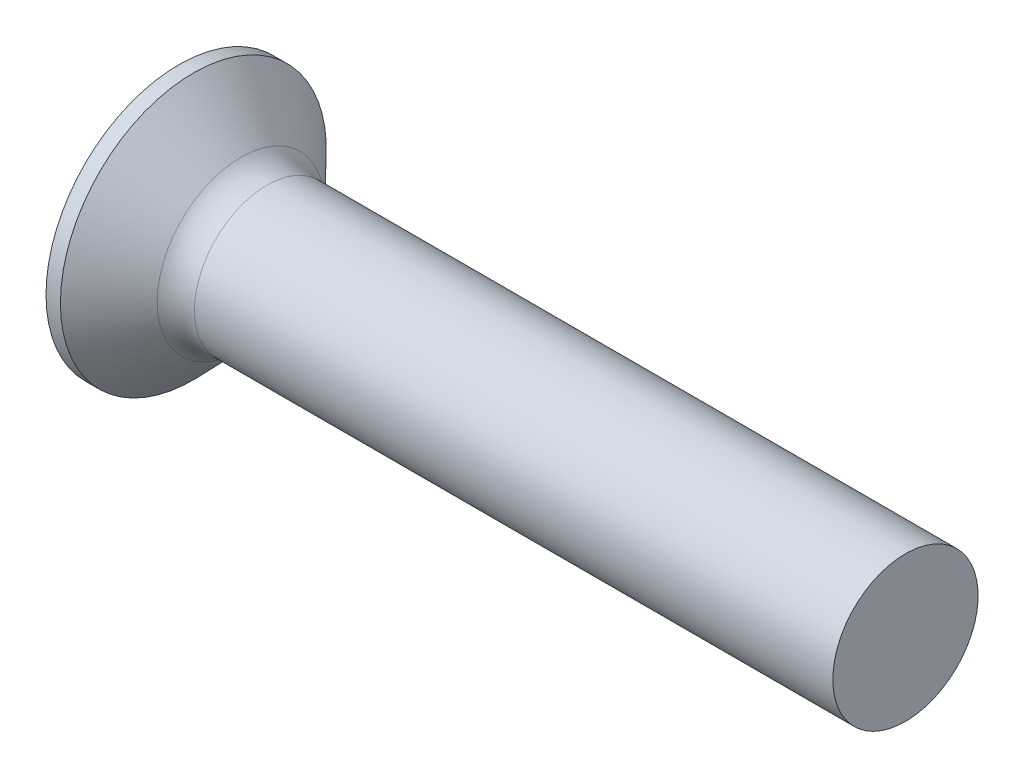
ISO-10303-21;
HEADER;
FILE_DESCRIPTION(('STEP AP214'),'2;1');
FILE_NAME('part.step','',(''),(''),'','','');
FILE_SCHEMA(('AUTOMOTIVE_DESIGN { 1 0 10303 214 1 1 1 1 }'));
ENDSEC;
DATA;
#1=APPLICATION_CONTEXT('core data for automotive mechanical design processes');
#2=APPLICATION_PROTOCOL_DEFINITION('international standard','automotive_design',2000,#1);
#3=PRODUCT_CONTEXT('',#1,'mechanical');
#4=PRODUCT('Part','Part','',(#3));
#5=PRODUCT_RELATED_PRODUCT_CATEGORY('part','',(#4));
#6=PRODUCT_DEFINITION_FORMATION('','',#4);
#7=PRODUCT_DEFINITION_CONTEXT('part definition',#1,'design');
#8=PRODUCT_DEFINITION('design','',#6,#7);
#9=PRODUCT_DEFINITION_SHAPE('','',#8);
#10=(LENGTH_UNIT() NAMED_UNIT(*) SI_UNIT(.MILLI.,.METRE.));
#11=(NAMED_UNIT(*) PLANE_ANGLE_UNIT() SI_UNIT($,.RADIAN.));
#12=(NAMED_UNIT(*) SI_UNIT($,.STERADIAN.) SOLID_ANGLE_UNIT());
#13=UNCERTAINTY_MEASURE_WITH_UNIT(LENGTH_MEASURE(1.E-05),#10,'distance_accuracy_value','');
#14=(GEOMETRIC_REPRESENTATION_CONTEXT(3) GLOBAL_UNCERTAINTY_ASSIGNED_CONTEXT((#13)) GLOBAL_UNIT_ASSIGNED_CONTEXT((#10,
#11,#12)) REPRESENTATION_CONTEXT('',''));
#15=CARTESIAN_POINT('',(0.,0.,0.));
#16=DIRECTION('',(0.,0.,1.));
#17=DIRECTION('',(1.,0.,0.));
#18=AXIS2_PLACEMENT_3D('',#15,#16,#17);
#19=CARTESIAN_POINT('',(5.64,-2.08800020083358,1.08));
#20=DIRECTION('',(0.,0.,-1.));
#21=DIRECTION('',(0.,1.,0.));
#22=AXIS2_PLACEMENT_3D('',#19,#20,#21);
#23=PLANE('',#22);
#24=DIRECTION('',(0.,-1.,0.));
#25=VECTOR('',#24,1.);
#26=CARTESIAN_POINT('',(0.,4.9,1.08));
#27=LINE('',#26,#25);
#28=CARTESIAN_POINT('',(0.,-2.05881047761803,1.08));
#29=VERTEX_POINT('',#28);
#30=CARTESIAN_POINT('',(0.,-4.9,1.08));
#31=VERTEX_POINT('',#30);
#32=EDGE_CURVE('E304',#29,#31,#27,.T.);
#33=ORIENTED_EDGE('',*,*,#32,.F.);
#34=CARTESIAN_POINT('',(-3.508552371452,-2.33231165002222,1.08));
#35=CARTESIAN_POINT('',(-2.8021242785535,-2.27786290347494,1.08));
#36=CARTESIAN_POINT('',(-2.09572000083794,-2.22310096882498,1.08));
#37=CARTESIAN_POINT('',(-0.682963739884883,-2.11273813340588,1.08));
#38=CARTESIAN_POINT('',(0.023388242128016,-2.05713721697088,1.08));
#39=CARTESIAN_POINT('',(1.08285390271521,-1.97294867301993,1.08));
#40=CARTESIAN_POINT('',(1.43599884659094,-1.94475462132179,1.08));
#41=CARTESIAN_POINT('',(2.14226366201043,-1.88806550876942,1.08));
#42=CARTESIAN_POINT('',(2.49538353361693,-1.8595704486972,1.08));
#43=CARTESIAN_POINT('',(3.2015889523463,-1.8022365024152,1.08));
#44=CARTESIAN_POINT('',(3.55467449997447,-1.77339762243347,1.08));
#45=CARTESIAN_POINT('',(4.26081605784269,-1.71532132056914,1.08));
#46=CARTESIAN_POINT('',(4.61387206778542,-1.68608389507013,1.08));
#47=CARTESIAN_POINT('',(5.41612732471709,-1.61911650604659,1.08));
#48=CARTESIAN_POINT('',(5.86531460668916,-1.58124295320442,1.08));
#49=CARTESIAN_POINT('',(6.76360881538388,-1.50456871786306,1.08));
#50=CARTESIAN_POINT('',(7.21271574234448,-1.46576803815681,1.08));
#51=CARTESIAN_POINT('',(8.11080846678724,-1.38699687421515,1.08));
#52=CARTESIAN_POINT('',(8.55979426851681,-1.34702643850978,1.08));
#53=CARTESIAN_POINT('',(9.45763439362018,-1.26556606443146,1.08));
#54=CARTESIAN_POINT('',(9.90648871523721,-1.22407610661242,1.08));
#55=CARTESIAN_POINT('',(10.804086472022,-1.13904091064148,1.08));
#56=CARTESIAN_POINT('',(11.2528298716191,-1.09549529593565,1.08));
#57=CARTESIAN_POINT('',(12.1500162616112,-1.00552937785306,1.08));
#58=CARTESIAN_POINT('',(12.5984592620319,-0.959109175798602,1.08));
#59=CARTESIAN_POINT('',(13.2708059653168,-0.8861578155995,1.08));
#60=CARTESIAN_POINT('',(13.4948891256712,-0.861284749868425,1.08));
#61=CARTESIAN_POINT('',(13.9428873803505,-0.810096676380915,1.08));
#62=CARTESIAN_POINT('',(14.1668024775431,-0.783781693824127,1.08));
#63=CARTESIAN_POINT('',(14.6144284155526,-0.729227223623335,1.08));
#64=CARTESIAN_POINT('',(14.8381392281789,-0.700987502036454,1.08));
#65=CARTESIAN_POINT('',(15.1734409779729,-0.656575769482208,1.08));
#66=CARTESIAN_POINT('',(15.2851674140663,-0.64142936052081,1.08));
#67=CARTESIAN_POINT('',(15.5085023247459,-0.610277030221323,1.08));
#68=CARTESIAN_POINT('',(15.6201107970542,-0.594271092583295,1.08));
#69=CARTESIAN_POINT('',(15.731644359719,-0.577747837441693,1.08));
#70=B_SPLINE_CURVE_WITH_KNOTS('',3,(#34,#35,#36,#37,#38,#39,#40,#41,#42,#43,#44,#45,#46,#47,#48,
#49,#50,#51,#52,#53,#54,#55,#56,#57,#58,#59,#60,#61,#62,#63,#64,#65,#66,#67,#68,#69),
.UNSPECIFIED.,.F.,.F.,(4,2,2,2,2,2,2,2,2,2,2,2,2,2,2,2,2,4),(0.,2.12557045381571,
4.25118064652266,5.31398639952898,6.37678939206669,7.4395731618212,8.50236658170693,
9.85470917308544,11.2070476910761,12.559330183477,13.9116299877686,15.2641784740572,
16.6166793133679,17.2930539423714,17.9694167544874,18.6458619223979,18.984104295463,
19.3223530851586),.UNSPECIFIED.);
#71=CARTESIAN_POINT('',(5.64,-1.60013444747621,1.08));
#72=VERTEX_POINT('',#71);
#73=EDGE_CURVE('E190',#29,#72,#70,.T.);
#74=ORIENTED_EDGE('',*,*,#73,.T.);
#75=DIRECTION('',(0.,-1.,0.));
#76=VECTOR('',#75,1.);
#77=CARTESIAN_POINT('',(5.64,2.08800020083358,1.08));
#78=LINE('',#77,#76);
#79=CARTESIAN_POINT('',(5.64,-2.08800020083358,1.08));
#80=VERTEX_POINT('',#79);
#81=EDGE_CURVE('E328',#72,#80,#78,.T.);
#82=ORIENTED_EDGE('',*,*,#81,.T.);
#83=DIRECTION('',(0.894934391398443,0.446197753347436,0.));
#84=VECTOR('',#83,1.);
#85=CARTESIAN_POINT('',(0.,-4.9,1.08));
#86=LINE('',#85,#84);
#87=EDGE_CURVE('E315',#31,#80,#86,.T.);
#88=ORIENTED_EDGE('',*,*,#87,.F.);
#89=EDGE_LOOP('',(#33,#74,#82,#88));
#90=FACE_BOUND('',#89,.T.);
#91=ADVANCED_FACE('F34',(#90),#23,.T.);
#92=CARTESIAN_POINT('',(5.64,2.08800020083359,1.08));
#93=VERTEX_POINT('',#92);
#94=CARTESIAN_POINT('',(5.64,1.60013444747621,1.08));
#95=VERTEX_POINT('',#94);
#96=EDGE_CURVE('E330',#93,#95,#78,.T.);
#97=ORIENTED_EDGE('',*,*,#96,.T.);
#98=CARTESIAN_POINT('',(-3.508552371452,2.33231165002222,1.08));
#99=CARTESIAN_POINT('',(-2.8021242785535,2.27786290347494,1.08));
#100=CARTESIAN_POINT('',(-2.09572000083793,2.22310096882498,1.08));
#101=CARTESIAN_POINT('',(-0.682963739884882,2.11273813340588,1.08));
#102=CARTESIAN_POINT('',(0.0233882421280164,2.05713721697088,1.08));
#103=CARTESIAN_POINT('',(1.08285390271521,1.97294867301993,1.08));
#104=CARTESIAN_POINT('',(1.43599884659094,1.94475462132179,1.08));
#105=CARTESIAN_POINT('',(2.14226366201043,1.88806550876942,1.08));
#106=CARTESIAN_POINT('',(2.49538353361693,1.8595704486972,1.08));
#107=CARTESIAN_POINT('',(3.2015889523463,1.8022365024152,1.08));
#108=CARTESIAN_POINT('',(3.55467449997447,1.77339762243347,1.08));
#109=CARTESIAN_POINT('',(4.26081605784269,1.71532132056914,1.08));
#110=CARTESIAN_POINT('',(4.61387206778542,1.68608389507013,1.08));
#111=CARTESIAN_POINT('',(5.41612732471709,1.61911650604659,1.08));
#112=CARTESIAN_POINT('',(5.86531460668916,1.58124295320442,1.08));
#113=CARTESIAN_POINT('',(6.76360881538388,1.50456871786306,1.08));
#114=CARTESIAN_POINT('',(7.21271574234448,1.46576803815681,1.08));
#115=CARTESIAN_POINT('',(8.11080846678724,1.38699687421515,1.08));
#116=CARTESIAN_POINT('',(8.55979426851681,1.34702643850978,1.08));
#117=CARTESIAN_POINT('',(9.45763439362018,1.26556606443146,1.08));
#118=CARTESIAN_POINT('',(9.90648871523721,1.22407610661242,1.08));
#119=CARTESIAN_POINT('',(10.804086472022,1.13904091064148,1.08));
#120=CARTESIAN_POINT('',(11.2528298716191,1.09549529593565,1.08));
#121=CARTESIAN_POINT('',(12.1500162616112,1.00552937785306,1.08));
#122=CARTESIAN_POINT('',(12.5984592620319,0.959109175798602,1.08));
#123=CARTESIAN_POINT('',(13.2708059653168,0.8861578155995,1.08));
#124=CARTESIAN_POINT('',(13.4948891256712,0.861284749868425,1.08));
#125=CARTESIAN_POINT('',(13.9428873803505,0.810096676380915,1.08));
#126=CARTESIAN_POINT('',(14.1668024775431,0.783781693824127,1.08));
#127=CARTESIAN_POINT('',(14.6144284155526,0.729227223623334,1.08));
#128=CARTESIAN_POINT('',(14.8381392281789,0.700987502036454,1.08));
#129=CARTESIAN_POINT('',(15.1734409779729,0.656575769482207,1.08));
#130=CARTESIAN_POINT('',(15.2851674140663,0.64142936052081,1.08));
#131=CARTESIAN_POINT('',(15.5085023247459,0.610277030221323,1.08));
#132=CARTESIAN_POINT('',(15.6201107970543,0.594271092583295,1.08));
#133=CARTESIAN_POINT('',(15.731644359719,0.577747837441693,1.08));
#134=B_SPLINE_CURVE_WITH_KNOTS('',3,(#98,#99,#100,#101,#102,#103,#104,#105,#106,#107,#108,#109,
#110,#111,#112,#113,#114,#115,#116,#117,#118,#119,#120,#121,#122,#123,#124,#125,#126,#127,#128,
#129,#130,#131,#132,#133),.UNSPECIFIED.,.F.,.F.,(4,2,2,2,2,2,2,2,2,2,2,2,2,2,2,2,2,4),(0.,
2.12557045381571,4.25118064652265,5.31398639952898,6.37678939206668,7.43957316182119,
8.50236658170693,9.85470917308544,11.2070476910761,12.559330183477,13.9116299877686,
15.2641784740572,16.6166793133679,17.2930539423714,17.9694167544874,18.6458619223979,
18.984104295463,19.3223530851586),.UNSPECIFIED.);
#135=CARTESIAN_POINT('',(0.,2.05881047761803,1.08));
#136=VERTEX_POINT('',#135);
#137=EDGE_CURVE('E184',#95,#136,#134,.F.);
#138=ORIENTED_EDGE('',*,*,#137,.T.);
#139=CARTESIAN_POINT('',(0.,4.9,1.08));
#140=VERTEX_POINT('',#139);
#141=EDGE_CURVE('E306',#140,#136,#27,.T.);
#142=ORIENTED_EDGE('',*,*,#141,.F.);
#143=DIRECTION('',(0.894934391398442,-0.446197753347436,0.));
#144=VECTOR('',#143,1.);
#145=CARTESIAN_POINT('',(0.,4.9,1.08));
#146=LINE('',#145,#144);
#147=EDGE_CURVE('E62',#140,#93,#146,.T.);
#148=ORIENTED_EDGE('',*,*,#147,.T.);
#149=EDGE_LOOP('',(#97,#138,#142,#148));
#150=FACE_BOUND('',#149,.T.);
#151=ADVANCED_FACE('F166',(#150),#23,.T.);
#152=CARTESIAN_POINT('',(5.64,2.08800020083359,-1.08));
#153=DIRECTION('',(0.,0.,1.));
#154=DIRECTION('',(0.,-1.,0.));
#155=AXIS2_PLACEMENT_3D('',#152,#153,#154);
#156=PLANE('',#155);
#157=DIRECTION('',(0.,1.,0.));
#158=VECTOR('',#157,1.);
#159=CARTESIAN_POINT('',(5.64,-2.08800020083359,-1.08));
#160=LINE('',#159,#158);
#161=CARTESIAN_POINT('',(5.64,-2.08800020083359,-1.08));
#162=VERTEX_POINT('',#161);
#163=CARTESIAN_POINT('',(5.64,-1.60013444747621,-1.08));
#164=VERTEX_POINT('',#163);
#165=EDGE_CURVE('E329',#162,#164,#160,.T.);
#166=ORIENTED_EDGE('',*,*,#165,.T.);
#167=CARTESIAN_POINT('',(-3.508552371452,-2.33231165002222,-1.08));
#168=CARTESIAN_POINT('',(-2.8021242785535,-2.27786290347494,-1.08));
#169=CARTESIAN_POINT('',(-2.09572000083793,-2.22310096882498,-1.08));
#170=CARTESIAN_POINT('',(-0.682963739884882,-2.11273813340588,-1.08));
#171=CARTESIAN_POINT('',(0.0233882421280164,-2.05713721697088,-1.08));
#172=CARTESIAN_POINT('',(1.08285390271521,-1.97294867301993,-1.08));
#173=CARTESIAN_POINT('',(1.43599884659094,-1.94475462132179,-1.08));
#174=CARTESIAN_POINT('',(2.14226366201043,-1.88806550876942,-1.08));
#175=CARTESIAN_POINT('',(2.49538353361693,-1.8595704486972,-1.08));
#176=CARTESIAN_POINT('',(3.2015889523463,-1.8022365024152,-1.08));
#177=CARTESIAN_POINT('',(3.55467449997447,-1.77339762243347,-1.08));
#178=CARTESIAN_POINT('',(4.26081605784269,-1.71532132056914,-1.08));
#179=CARTESIAN_POINT('',(4.61387206778542,-1.68608389507013,-1.08));
#180=CARTESIAN_POINT('',(5.41612732471709,-1.61911650604659,-1.08));
#181=CARTESIAN_POINT('',(5.86531460668916,-1.58124295320442,-1.08));
#182=CARTESIAN_POINT('',(6.76360881538388,-1.50456871786306,-1.08));
#183=CARTESIAN_POINT('',(7.21271574234448,-1.46576803815681,-1.08));
#184=CARTESIAN_POINT('',(8.11080846678724,-1.38699687421515,-1.08));
#185=CARTESIAN_POINT('',(8.55979426851681,-1.34702643850978,-1.08));
#186=CARTESIAN_POINT('',(9.45763439362018,-1.26556606443146,-1.08));
#187=CARTESIAN_POINT('',(9.90648871523721,-1.22407610661242,-1.08));
#188=CARTESIAN_POINT('',(10.804086472022,-1.13904091064148,-1.08));
#189=CARTESIAN_POINT('',(11.2528298716191,-1.09549529593565,-1.08));
#190=CARTESIAN_POINT('',(12.1500162616112,-1.00552937785306,-1.08));
#191=CARTESIAN_POINT('',(12.5984592620319,-0.959109175798602,-1.08));
#192=CARTESIAN_POINT('',(13.2708059653168,-0.8861578155995,-1.08));
#193=CARTESIAN_POINT('',(13.4948891256712,-0.861284749868425,-1.08));
#194=CARTESIAN_POINT('',(13.9428873803505,-0.810096676380915,-1.08));
#195=CARTESIAN_POINT('',(14.1668024775431,-0.783781693824127,-1.08));
#196=CARTESIAN_POINT('',(14.6144284155526,-0.729227223623334,-1.08));
#197=CARTESIAN_POINT('',(14.8381392281789,-0.700987502036453,-1.08));
#198=CARTESIAN_POINT('',(15.1734409779729,-0.656575769482206,-1.08));
#199=CARTESIAN_POINT('',(15.2851674140663,-0.641429360520809,-1.08));
#200=CARTESIAN_POINT('',(15.5085023247459,-0.610277030221322,-1.08));
#201=CARTESIAN_POINT('',(15.6201107970543,-0.594271092583294,-1.08));
#202=CARTESIAN_POINT('',(15.731644359719,-0.577747837441693,-1.08));
#203=B_SPLINE_CURVE_WITH_KNOTS('',3,(#167,#168,#169,#170,#171,#172,#173,#174,#175,#176,#177,
#178,#179,#180,#181,#182,#183,#184,#185,#186,#187,#188,#189,#190,#191,#192,#193,#194,#195,#196,
#197,#198,#199,#200,#201,#202),.UNSPECIFIED.,.F.,.F.,(4,2,2,2,2,2,2,2,2,2,2,2,2,2,2,2,2,4),(0.,
2.12557045381571,4.25118064652265,5.31398639952898,6.37678939206668,7.43957316182119,
8.50236658170693,9.85470917308544,11.2070476910761,12.559330183477,13.9116299877686,
15.2641784740572,16.6166793133679,17.2930539423714,17.9694167544874,18.6458619223979,
18.984104295463,19.3223530851586),.UNSPECIFIED.);
#204=CARTESIAN_POINT('',(0.,-2.05881047761803,-1.08));
#205=VERTEX_POINT('',#204);
#206=EDGE_CURVE('E231',#164,#205,#203,.F.);
#207=ORIENTED_EDGE('',*,*,#206,.T.);
#208=DIRECTION('',(0.,1.,0.));
#209=VECTOR('',#208,1.);
#210=CARTESIAN_POINT('',(0.,-4.9,-1.08));
#211=LINE('',#210,#209);
#212=CARTESIAN_POINT('',(0.,-4.9,-1.08));
#213=VERTEX_POINT('',#212);
#214=EDGE_CURVE('E305',#213,#205,#211,.T.);
#215=ORIENTED_EDGE('',*,*,#214,.F.);
#216=DIRECTION('',(0.894934391398443,0.446197753347436,0.));
#217=VECTOR('',#216,1.);
#218=CARTESIAN_POINT('',(0.,-4.9,-1.08));
#219=LINE('',#218,#217);
#220=EDGE_CURVE('E318',#213,#162,#219,.T.);
#221=ORIENTED_EDGE('',*,*,#220,.T.);
#222=EDGE_LOOP('',(#166,#207,#215,#221));
#223=FACE_BOUND('',#222,.T.);
#224=ADVANCED_FACE('F172',(#223),#156,.T.);
#225=CARTESIAN_POINT('',(0.,2.05881047761803,-1.08));
#226=VERTEX_POINT('',#225);
#227=CARTESIAN_POINT('',(0.,4.9,-1.08));
#228=VERTEX_POINT('',#227);
#229=EDGE_CURVE('E314',#226,#228,#211,.T.);
#230=ORIENTED_EDGE('',*,*,#229,.F.);
#231=CARTESIAN_POINT('',(-3.508552371452,2.33231165002222,-1.08));
#232=CARTESIAN_POINT('',(-2.8021242785535,2.27786290347494,-1.08));
#233=CARTESIAN_POINT('',(-2.09572000083794,2.22310096882498,-1.08));
#234=CARTESIAN_POINT('',(-0.682963739884883,2.11273813340588,-1.08));
#235=CARTESIAN_POINT('',(0.023388242128016,2.05713721697088,-1.08));
#236=CARTESIAN_POINT('',(1.08285390271521,1.97294867301993,-1.08));
#237=CARTESIAN_POINT('',(1.43599884659094,1.94475462132179,-1.08));
#238=CARTESIAN_POINT('',(2.14226366201043,1.88806550876942,-1.08));
#239=CARTESIAN_POINT('',(2.49538353361693,1.8595704486972,-1.08));
#240=CARTESIAN_POINT('',(3.2015889523463,1.8022365024152,-1.08));
#241=CARTESIAN_POINT('',(3.55467449997447,1.77339762243347,-1.08));
#242=CARTESIAN_POINT('',(4.26081605784269,1.71532132056914,-1.08));
#243=CARTESIAN_POINT('',(4.61387206778542,1.68608389507013,-1.08));
#244=CARTESIAN_POINT('',(5.41612732471709,1.61911650604659,-1.08));
#245=CARTESIAN_POINT('',(5.86531460668916,1.58124295320442,-1.08));
#246=CARTESIAN_POINT('',(6.76360881538388,1.50456871786306,-1.08));
#247=CARTESIAN_POINT('',(7.21271574234448,1.46576803815681,-1.08));
#248=CARTESIAN_POINT('',(8.11080846678724,1.38699687421515,-1.08));
#249=CARTESIAN_POINT('',(8.55979426851681,1.34702643850978,-1.08));
#250=CARTESIAN_POINT('',(9.45763439362018,1.26556606443146,-1.08));
#251=CARTESIAN_POINT('',(9.90648871523721,1.22407610661242,-1.08));
#252=CARTESIAN_POINT('',(10.804086472022,1.13904091064148,-1.08));
#253=CARTESIAN_POINT('',(11.2528298716191,1.09549529593565,-1.08));
#254=CARTESIAN_POINT('',(12.1500162616112,1.00552937785306,-1.08));
#255=CARTESIAN_POINT('',(12.5984592620319,0.959109175798602,-1.08));
#256=CARTESIAN_POINT('',(13.2708059653168,0.8861578155995,-1.08));
#257=CARTESIAN_POINT('',(13.4948891256712,0.861284749868425,-1.08));
#258=CARTESIAN_POINT('',(13.9428873803505,0.810096676380915,-1.08));
#259=CARTESIAN_POINT('',(14.1668024775431,0.783781693824127,-1.08));
#260=CARTESIAN_POINT('',(14.6144284155526,0.729227223623335,-1.08));
#261=CARTESIAN_POINT('',(14.8381392281789,0.700987502036455,-1.08));
#262=CARTESIAN_POINT('',(15.1734409779729,0.656575769482208,-1.08));
#263=CARTESIAN_POINT('',(15.2851674140663,0.641429360520811,-1.08));
#264=CARTESIAN_POINT('',(15.5085023247459,0.610277030221324,-1.08));
#265=CARTESIAN_POINT('',(15.6201107970542,0.594271092583296,-1.08));
#266=CARTESIAN_POINT('',(15.731644359719,0.577747837441694,-1.08));
#267=B_SPLINE_CURVE_WITH_KNOTS('',3,(#231,#232,#233,#234,#235,#236,#237,#238,#239,#240,#241,
#242,#243,#244,#245,#246,#247,#248,#249,#250,#251,#252,#253,#254,#255,#256,#257,#258,#259,#260,
#261,#262,#263,#264,#265,#266),.UNSPECIFIED.,.F.,.F.,(4,2,2,2,2,2,2,2,2,2,2,2,2,2,2,2,2,4),(0.,
2.12557045381571,4.25118064652266,5.31398639952898,6.37678939206669,7.4395731618212,
8.50236658170693,9.85470917308544,11.2070476910761,12.559330183477,13.9116299877686,
15.2641784740572,16.6166793133679,17.2930539423714,17.9694167544874,18.6458619223979,
18.984104295463,19.3223530851586),.UNSPECIFIED.);
#268=CARTESIAN_POINT('',(5.64,1.60013444747621,-1.08));
#269=VERTEX_POINT('',#268);
#270=EDGE_CURVE('E227',#226,#269,#267,.T.);
#271=ORIENTED_EDGE('',*,*,#270,.T.);
#272=CARTESIAN_POINT('',(5.64,2.08800020083358,-1.08));
#273=VERTEX_POINT('',#272);
#274=EDGE_CURVE('E335',#269,#273,#160,.T.);
#275=ORIENTED_EDGE('',*,*,#274,.T.);
#276=DIRECTION('',(0.894934391398443,-0.446197753347436,0.));
#277=VECTOR('',#276,1.);
#278=CARTESIAN_POINT('',(0.,4.9,-1.08));
#279=LINE('',#278,#277);
#280=EDGE_CURVE('E322',#228,#273,#279,.T.);
#281=ORIENTED_EDGE('',*,*,#280,.F.);
#282=EDGE_LOOP('',(#230,#271,#275,#281));
#283=FACE_BOUND('',#282,.T.);
#284=ADVANCED_FACE('F451',(#283),#156,.T.);
#285=CARTESIAN_POINT('',(5.64,2.08800020083358,-1.08));
#286=DIRECTION('',(1.,0.,0.));
#287=DIRECTION('',(0.,0.,-1.));
#288=AXIS2_PLACEMENT_3D('',#285,#286,#287);
#289=PLANE('',#288);
#290=CARTESIAN_POINT('',(5.64,0.,0.));
#291=DIRECTION('',(-1.,0.,0.));
#292=DIRECTION('',(0.,0.,1.));
#293=AXIS2_PLACEMENT_3D('',#290,#291,#292);
#294=CIRCLE('',#293,1.9305);
#295=EDGE_CURVE('E274',#164,#72,#294,.T.);
#296=ORIENTED_EDGE('',*,*,#295,.F.);
#297=ORIENTED_EDGE('',*,*,#165,.F.);
#298=DIRECTION('',(0.,0.,-1.));
#299=VECTOR('',#298,1.);
#300=CARTESIAN_POINT('',(5.64,-2.08800020083358,1.08));
#301=LINE('',#300,#299);
#302=EDGE_CURVE('E325',#80,#162,#301,.T.);
#303=ORIENTED_EDGE('',*,*,#302,.F.);
#304=ORIENTED_EDGE('',*,*,#81,.F.);
#305=EDGE_LOOP('',(#296,#297,#303,#304));
#306=FACE_BOUND('',#305,.T.);
#307=ADVANCED_FACE('F408',(#306),#289,.F.);
#308=CARTESIAN_POINT('',(5.64,-1.08000000000001,1.60013444747621));
#309=VERTEX_POINT('',#308);
#310=CARTESIAN_POINT('',(5.64,1.07999999999999,1.60013444747622));
#311=VERTEX_POINT('',#310);
#312=EDGE_CURVE('E267',#309,#311,#294,.T.);
#313=ORIENTED_EDGE('',*,*,#312,.F.);
#314=DIRECTION('',(0.,0.,-1.));
#315=VECTOR('',#314,1.);
#316=CARTESIAN_POINT('',(5.64,-1.08000000000001,2.08800020083358));
#317=LINE('',#316,#315);
#318=CARTESIAN_POINT('',(5.64,-1.08000000000001,2.08800020083358));
#319=VERTEX_POINT('',#318);
#320=EDGE_CURVE('E393',#319,#309,#317,.T.);
#321=ORIENTED_EDGE('',*,*,#320,.F.);
#322=DIRECTION('',(0.,-1.,0.));
#323=VECTOR('',#322,1.);
#324=CARTESIAN_POINT('',(5.64,1.07999999999999,2.08800020083359));
#325=LINE('',#324,#323);
#326=CARTESIAN_POINT('',(5.64,1.07999999999999,2.08800020083359));
#327=VERTEX_POINT('',#326);
#328=EDGE_CURVE('E293',#327,#319,#325,.T.);
#329=ORIENTED_EDGE('',*,*,#328,.F.);
#330=DIRECTION('',(0.,0.,1.));
#331=VECTOR('',#330,1.);
#332=CARTESIAN_POINT('',(5.64,1.08000000000001,-2.08800020083358));
#333=LINE('',#332,#331);
#334=EDGE_CURVE('E196',#311,#327,#333,.T.);
#335=ORIENTED_EDGE('',*,*,#334,.F.);
#336=EDGE_LOOP('',(#313,#321,#329,#335));
#337=FACE_BOUND('',#336,.T.);
#338=ADVANCED_FACE('F443',(#337),#289,.F.);
#339=EDGE_CURVE('E266',#95,#269,#294,.T.);
#340=ORIENTED_EDGE('',*,*,#339,.F.);
#341=ORIENTED_EDGE('',*,*,#96,.F.);
#342=DIRECTION('',(0.,0.,1.));
#343=VECTOR('',#342,1.);
#344=CARTESIAN_POINT('',(5.64,2.08800020083358,-1.08));
#345=LINE('',#344,#343);
#346=EDGE_CURVE('E326',#273,#93,#345,.T.);
#347=ORIENTED_EDGE('',*,*,#346,.F.);
#348=ORIENTED_EDGE('',*,*,#274,.F.);
#349=EDGE_LOOP('',(#340,#341,#347,#348));
#350=FACE_BOUND('',#349,.T.);
#351=ADVANCED_FACE('F423',(#350),#289,.F.);
#352=CARTESIAN_POINT('',(5.64,1.07999999999999,2.08800020083359));
#353=DIRECTION('',(0.,-1.,0.));
#354=DIRECTION('',(0.,0.,-1.));
#355=AXIS2_PLACEMENT_3D('',#352,#353,#354);
#356=PLANE('',#355);
#357=CARTESIAN_POINT('',(5.64,1.08000000000001,-2.08800020083358));
#358=VERTEX_POINT('',#357);
#359=CARTESIAN_POINT('',(5.64,1.08000000000001,-1.60013444747621));
#360=VERTEX_POINT('',#359);
#361=EDGE_CURVE('E288',#358,#360,#333,.T.);
#362=ORIENTED_EDGE('',*,*,#361,.T.);
#363=CARTESIAN_POINT('',(-3.508552371452,1.08000000000001,-2.33231165002222));
#364=CARTESIAN_POINT('',(-2.8021242785535,1.08000000000001,-2.27786290347493));
#365=CARTESIAN_POINT('',(-2.09572000083793,1.08000000000001,-2.22310096882497));
#366=CARTESIAN_POINT('',(-0.682963739884882,1.08000000000001,-2.11273813340588));
#367=CARTESIAN_POINT('',(0.0233882421280166,1.08000000000001,-2.05713721697088));
#368=CARTESIAN_POINT('',(1.08285390271521,1.08000000000001,-1.97294867301992));
#369=CARTESIAN_POINT('',(1.43599884659094,1.08000000000001,-1.94475462132178));
#370=CARTESIAN_POINT('',(2.14226366201043,1.08000000000001,-1.88806550876941));
#371=CARTESIAN_POINT('',(2.49538353361693,1.08000000000001,-1.8595704486972));
#372=CARTESIAN_POINT('',(3.2015889523463,1.08000000000001,-1.8022365024152));
#373=CARTESIAN_POINT('',(3.55467449997447,1.08000000000001,-1.77339762243347));
#374=CARTESIAN_POINT('',(4.26081605784269,1.08000000000001,-1.71532132056914));
#375=CARTESIAN_POINT('',(4.61387206778542,1.08000000000001,-1.68608389507012));
#376=CARTESIAN_POINT('',(5.41612732471709,1.08000000000001,-1.61911650604659));
#377=CARTESIAN_POINT('',(5.86531460668917,1.08000000000001,-1.58124295320442));
#378=CARTESIAN_POINT('',(6.76360881538388,1.08000000000001,-1.50456871786305));
#379=CARTESIAN_POINT('',(7.21271574234448,1.08000000000001,-1.46576803815681));
#380=CARTESIAN_POINT('',(8.11080846678724,1.08,-1.38699687421514));
#381=CARTESIAN_POINT('',(8.55979426851682,1.08,-1.34702643850977));
#382=CARTESIAN_POINT('',(9.45763439362019,1.08,-1.26556606443145));
#383=CARTESIAN_POINT('',(9.90648871523721,1.08,-1.22407610661242));
#384=CARTESIAN_POINT('',(10.804086472022,1.08,-1.13904091064148));
#385=CARTESIAN_POINT('',(11.2528298716191,1.08,-1.09549529593564));
#386=CARTESIAN_POINT('',(12.1500162616112,1.08,-1.00552937785305));
#387=CARTESIAN_POINT('',(12.5984592620319,1.08,-0.959109175798598));
#388=CARTESIAN_POINT('',(13.2708059653168,1.08,-0.886157815599496));
#389=CARTESIAN_POINT('',(13.4948891256712,1.08,-0.861284749868421));
#390=CARTESIAN_POINT('',(13.9428873803505,1.08,-0.810096676380911));
#391=CARTESIAN_POINT('',(14.1668024775431,1.08,-0.783781693824123));
#392=CARTESIAN_POINT('',(14.6144284155526,1.08,-0.729227223623331));
#393=CARTESIAN_POINT('',(14.8381392281789,1.08,-0.70098750203645));
#394=CARTESIAN_POINT('',(15.1734409779729,1.08,-0.656575769482203));
#395=CARTESIAN_POINT('',(15.2851674140663,1.08,-0.641429360520806));
#396=CARTESIAN_POINT('',(15.5085023247459,1.08,-0.610277030221319));
#397=CARTESIAN_POINT('',(15.6201107970542,1.08,-0.594271092583291));
#398=CARTESIAN_POINT('',(15.731644359719,1.08,-0.577747837441689));
#399=B_SPLINE_CURVE_WITH_KNOTS('',3,(#363,#364,#365,#366,#367,#368,#369,#370,#371,#372,#373,
#374,#375,#376,#377,#378,#379,#380,#381,#382,#383,#384,#385,#386,#387,#388,#389,#390,#391,#392,
#393,#394,#395,#396,#397,#398),.UNSPECIFIED.,.F.,.F.,(4,2,2,2,2,2,2,2,2,2,2,2,2,2,2,2,2,4),(0.,
2.12557045381571,4.25118064652265,5.31398639952898,6.37678939206668,7.43957316182119,
8.50236658170693,9.85470917308545,11.2070476910761,12.559330183477,13.9116299877686,
15.2641784740572,16.6166793133679,17.2930539423714,17.9694167544874,18.6458619223979,
18.984104295463,19.3223530851586),.UNSPECIFIED.);
#400=CARTESIAN_POINT('',(0.,1.08000000000001,-2.05881047761803));
#401=VERTEX_POINT('',#400);
#402=EDGE_CURVE('E221',#360,#401,#399,.F.);
#403=ORIENTED_EDGE('',*,*,#402,.T.);
#404=DIRECTION('',(0.,0.,1.));
#405=VECTOR('',#404,1.);
#406=CARTESIAN_POINT('',(0.,1.08000000000002,-4.9));
#407=LINE('',#406,#405);
#408=CARTESIAN_POINT('',(0.,1.08000000000002,-4.9));
#409=VERTEX_POINT('',#408);
#410=EDGE_CURVE('E382',#409,#401,#407,.T.);
#411=ORIENTED_EDGE('',*,*,#410,.F.);
#412=DIRECTION('',(0.894934391398443,0.,0.446197753347436));
#413=VECTOR('',#412,1.);
#414=CARTESIAN_POINT('',(0.,1.08000000000002,-4.9));
#415=LINE('',#414,#413);
#416=EDGE_CURVE('E292',#409,#358,#415,.T.);
#417=ORIENTED_EDGE('',*,*,#416,.T.);
#418=EDGE_LOOP('',(#362,#403,#411,#417));
#419=FACE_BOUND('',#418,.T.);
#420=ADVANCED_FACE('F291',(#419),#356,.T.);
#421=CARTESIAN_POINT('',(5.64,-1.07999999999999,-2.08800020083359));
#422=DIRECTION('',(0.,1.,0.));
#423=DIRECTION('',(0.,0.,1.));
#424=AXIS2_PLACEMENT_3D('',#421,#422,#423);
#425=PLANE('',#424);
#426=DIRECTION('',(0.,0.,-1.));
#427=VECTOR('',#426,1.);
#428=CARTESIAN_POINT('',(0.,-1.08000000000002,4.9));
#429=LINE('',#428,#427);
#430=CARTESIAN_POINT('',(0.,-1.07999999999999,-2.05881047761803));
#431=VERTEX_POINT('',#430);
#432=CARTESIAN_POINT('',(0.,-1.07999999999998,-4.9));
#433=VERTEX_POINT('',#432);
#434=EDGE_CURVE('E378',#431,#433,#429,.T.);
#435=ORIENTED_EDGE('',*,*,#434,.F.);
#436=CARTESIAN_POINT('',(-3.50855235785895,-1.07999999999999,-2.33231164897475));
#437=CARTESIAN_POINT('',(-2.80212426669874,-1.07999999999999,-2.27786290255719));
#438=CARTESIAN_POINT('',(-2.09571999072138,-1.07999999999999,-2.22310096803798));
#439=CARTESIAN_POINT('',(-0.682963733244686,-1.07999999999999,-2.11273813288379));
#440=CARTESIAN_POINT('',(0.0233882470300694,-1.07999999999999,-2.05713721658294));
#441=CARTESIAN_POINT('',(1.0828539044558,-1.07999999999999,-1.97294867288083));
#442=CARTESIAN_POINT('',(1.43599884690811,-1.07999999999999,-1.94475462129602));
#443=CARTESIAN_POINT('',(2.14226365948097,-1.07999999999999,-1.88806550897277));
#444=CARTESIAN_POINT('',(2.49538352966426,-1.07999999999999,-1.85957044901634));
#445=CARTESIAN_POINT('',(3.20158894554756,-1.07999999999999,-1.80223650296893));
#446=CARTESIAN_POINT('',(3.55467449175288,-1.07999999999999,-1.773397623106));
#447=CARTESIAN_POINT('',(4.26081604677565,-1.07999999999999,-1.715321321483));
#448=CARTESIAN_POINT('',(4.61387205529579,-1.07999999999999,-1.68608389610653));
#449=CARTESIAN_POINT('',(5.41612731080518,-1.07999999999999,-1.61911650721573));
#450=CARTESIAN_POINT('',(5.86531459277744,-1.07999999999999,-1.58124295438217));
#451=CARTESIAN_POINT('',(6.76360880147275,-1.07999999999999,-1.50456871906016));
#452=CARTESIAN_POINT('',(7.21271572843376,-1.08,-1.46576803936464));
#453=CARTESIAN_POINT('',(8.11080845287784,-1.08,-1.38699687544742));
#454=CARTESIAN_POINT('',(8.55979425460832,-1.08,-1.34702643975574));
#455=CARTESIAN_POINT('',(9.45763437971387,-1.08,-1.26556606570916));
#456=CARTESIAN_POINT('',(9.90648870133217,-1.08,-1.22407610790817));
#457=CARTESIAN_POINT('',(10.8040864581195,-1.08,-1.13904091198014));
#458=CARTESIAN_POINT('',(11.2528298577178,-1.08,-1.09549529729918));
#459=CARTESIAN_POINT('',(12.1500162477138,-1.08,-1.00552937927742));
#460=CARTESIAN_POINT('',(12.5984592481373,-1.08,-0.959109177258921));
#461=CARTESIAN_POINT('',(13.2708059514278,-1.08,-0.886157817129854));
#462=CARTESIAN_POINT('',(13.4948891117843,-1.08,-0.861284751424839));
#463=CARTESIAN_POINT('',(13.9428873664685,-1.08,-0.810096677997516));
#464=CARTESIAN_POINT('',(14.1668024636642,-1.08,-0.783781695474855));
#465=CARTESIAN_POINT('',(14.6144284016815,-1.08,-0.729227225354877));
#466=CARTESIAN_POINT('',(14.8381392143124,-1.08,-0.700987503814688));
#467=CARTESIAN_POINT('',(15.1734409641157,-1.08,-0.656575771346784));
#468=CARTESIAN_POINT('',(15.2851674002126,-1.08,-0.641429362416894));
#469=CARTESIAN_POINT('',(15.5085023109006,-1.08,-0.610277032188302));
#470=CARTESIAN_POINT('',(15.6201107832138,-1.08,-0.594271094589663));
#471=CARTESIAN_POINT('',(15.7316443458843,-1.08,-0.577747839492609));
#472=B_SPLINE_CURVE_WITH_KNOTS('',3,(#436,#437,#438,#439,#440,#441,#442,#443,#444,#445,#446,
#447,#448,#449,#450,#451,#452,#453,#454,#455,#456,#457,#458,#459,#460,#461,#462,#463,#464,#465,
#466,#467,#468,#469,#470,#471),.UNSPECIFIED.,.F.,.F.,(4,2,2,2,2,2,2,2,2,2,2,2,2,2,2,2,2,4),(0.,
2.12557044858637,4.25118063606338,5.31398638478592,6.3767893730399,7.439573138511,
8.50236655411318,9.85470914549009,11.2070476634792,12.5593301558792,13.9116299601696,
15.2641784464547,16.6166792857626,17.2930539147632,17.9694167268767,18.6458618947834,
18.9841042678463,19.3223530575396),.UNSPECIFIED.);
#473=CARTESIAN_POINT('',(5.64,-1.07999999999999,-1.60013444747621));
#474=VERTEX_POINT('',#473);
#475=EDGE_CURVE('E215',#431,#474,#472,.T.);
#476=ORIENTED_EDGE('',*,*,#475,.T.);
#477=CARTESIAN_POINT('',(5.64,-1.07999999999999,-2.08800020083359));
#478=VERTEX_POINT('',#477);
#479=EDGE_CURVE('E290',#474,#478,#317,.T.);
#480=ORIENTED_EDGE('',*,*,#479,.T.);
#481=DIRECTION('',(0.894934391398443,0.,0.446197753347436));
#482=VECTOR('',#481,1.);
#483=CARTESIAN_POINT('',(0.,-1.07999999999998,-4.9));
#484=LINE('',#483,#482);
#485=EDGE_CURVE('E385',#433,#478,#484,.T.);
#486=ORIENTED_EDGE('',*,*,#485,.F.);
#487=EDGE_LOOP('',(#435,#476,#480,#486));
#488=FACE_BOUND('',#487,.T.);
#489=ADVANCED_FACE('F396',(#488),#425,.T.);
#490=ORIENTED_EDGE('',*,*,#320,.T.);
#491=CARTESIAN_POINT('',(-3.508552371452,-1.08000000000001,2.33231165002222));
#492=CARTESIAN_POINT('',(-2.8021242785535,-1.08000000000001,2.27786290347493));
#493=CARTESIAN_POINT('',(-2.09572000083794,-1.08000000000001,2.22310096882497));
#494=CARTESIAN_POINT('',(-0.682963739884883,-1.08000000000001,2.11273813340588));
#495=CARTESIAN_POINT('',(0.023388242128016,-1.08000000000001,2.05713721697088));
#496=CARTESIAN_POINT('',(1.08285390271521,-1.08000000000001,1.97294867301992));
#497=CARTESIAN_POINT('',(1.43599884659094,-1.08000000000001,1.94475462132178));
#498=CARTESIAN_POINT('',(2.14226366201044,-1.08000000000001,1.88806550876941));
#499=CARTESIAN_POINT('',(2.49538353361694,-1.08000000000001,1.8595704486972));
#500=CARTESIAN_POINT('',(3.2015889523463,-1.08000000000001,1.8022365024152));
#501=CARTESIAN_POINT('',(3.55467449997447,-1.08000000000001,1.77339762243347));
#502=CARTESIAN_POINT('',(4.26081605784269,-1.08000000000001,1.71532132056914));
#503=CARTESIAN_POINT('',(4.61387206778542,-1.08000000000001,1.68608389507012));
#504=CARTESIAN_POINT('',(5.41612732471709,-1.08000000000001,1.61911650604659));
#505=CARTESIAN_POINT('',(5.86531460668917,-1.08000000000001,1.58124295320442));
#506=CARTESIAN_POINT('',(6.76360881538388,-1.08000000000001,1.50456871786305));
#507=CARTESIAN_POINT('',(7.21271574234448,-1.08000000000001,1.46576803815681));
#508=CARTESIAN_POINT('',(8.11080846678724,-1.08,1.38699687421514));
#509=CARTESIAN_POINT('',(8.55979426851682,-1.08,1.34702643850977));
#510=CARTESIAN_POINT('',(9.45763439362018,-1.08,1.26556606443145));
#511=CARTESIAN_POINT('',(9.90648871523721,-1.08,1.22407610661242));
#512=CARTESIAN_POINT('',(10.804086472022,-1.08,1.13904091064148));
#513=CARTESIAN_POINT('',(11.2528298716191,-1.08,1.09549529593564));
#514=CARTESIAN_POINT('',(12.1500162616112,-1.08,1.00552937785305));
#515=CARTESIAN_POINT('',(12.5984592620319,-1.08,0.959109175798599));
#516=CARTESIAN_POINT('',(13.2708059653168,-1.08,0.886157815599496));
#517=CARTESIAN_POINT('',(13.4948891256712,-1.08,0.861284749868421));
#518=CARTESIAN_POINT('',(13.9428873803505,-1.08,0.810096676380912));
#519=CARTESIAN_POINT('',(14.1668024775431,-1.08,0.783781693824123));
#520=CARTESIAN_POINT('',(14.6144284155526,-1.08,0.729227223623332));
#521=CARTESIAN_POINT('',(14.8381392281789,-1.08,0.700987502036451));
#522=CARTESIAN_POINT('',(15.1734409779729,-1.08,0.656575769482204));
#523=CARTESIAN_POINT('',(15.2851674140663,-1.08,0.641429360520807));
#524=CARTESIAN_POINT('',(15.5085023247459,-1.08,0.61027703022132));
#525=CARTESIAN_POINT('',(15.6201107970542,-1.08,0.594271092583292));
#526=CARTESIAN_POINT('',(15.731644359719,-1.08,0.57774783744169));
#527=B_SPLINE_CURVE_WITH_KNOTS('',3,(#491,#492,#493,#494,#495,#496,#497,#498,#499,#500,#501,
#502,#503,#504,#505,#506,#507,#508,#509,#510,#511,#512,#513,#514,#515,#516,#517,#518,#519,#520,
#521,#522,#523,#524,#525,#526),.UNSPECIFIED.,.F.,.F.,(4,2,2,2,2,2,2,2,2,2,2,2,2,2,2,2,2,4),(0.,
2.12557045381571,4.25118064652266,5.31398639952898,6.37678939206669,7.4395731618212,
8.50236658170693,9.85470917308545,11.2070476910761,12.559330183477,13.9116299877686,
15.2641784740572,16.6166793133679,17.2930539423714,17.9694167544874,18.6458619223979,
18.984104295463,19.3223530851586),.UNSPECIFIED.);
#528=CARTESIAN_POINT('',(0.,-1.08000000000001,2.05881047761803));
#529=VERTEX_POINT('',#528);
#530=EDGE_CURVE('E208',#309,#529,#527,.F.);
#531=ORIENTED_EDGE('',*,*,#530,.T.);
#532=CARTESIAN_POINT('',(0.,-1.08000000000002,4.9));
#533=VERTEX_POINT('',#532);
#534=EDGE_CURVE('E374',#533,#529,#429,.T.);
#535=ORIENTED_EDGE('',*,*,#534,.F.);
#536=DIRECTION('',(0.894934391398442,0.,-0.446197753347436));
#537=VECTOR('',#536,1.);
#538=CARTESIAN_POINT('',(0.,-1.08000000000002,4.9));
#539=LINE('',#538,#537);
#540=EDGE_CURVE('E389',#533,#319,#539,.T.);
#541=ORIENTED_EDGE('',*,*,#540,.T.);
#542=EDGE_LOOP('',(#490,#531,#535,#541));
#543=FACE_BOUND('',#542,.T.);
#544=ADVANCED_FACE('F427',(#543),#425,.T.);
#545=CARTESIAN_POINT('',(0.,1.07999999999999,2.05881047761803));
#546=VERTEX_POINT('',#545);
#547=CARTESIAN_POINT('',(0.,1.07999999999998,4.9));
#548=VERTEX_POINT('',#547);
#549=EDGE_CURVE('E384',#546,#548,#407,.T.);
#550=ORIENTED_EDGE('',*,*,#549,.F.);
#551=CARTESIAN_POINT('',(-3.50855235785895,1.07999999999999,2.33231164897475));
#552=CARTESIAN_POINT('',(-2.80212426669874,1.07999999999999,2.27786290255719));
#553=CARTESIAN_POINT('',(-2.09571999072138,1.07999999999999,2.22310096803798));
#554=CARTESIAN_POINT('',(-0.682963733244685,1.07999999999999,2.11273813288379));
#555=CARTESIAN_POINT('',(0.0233882470300702,1.07999999999999,2.05713721658294));
#556=CARTESIAN_POINT('',(1.0828539044558,1.07999999999999,1.97294867288083));
#557=CARTESIAN_POINT('',(1.43599884690811,1.07999999999999,1.94475462129602));
#558=CARTESIAN_POINT('',(2.14226365948097,1.07999999999999,1.88806550897277));
#559=CARTESIAN_POINT('',(2.49538352966426,1.07999999999999,1.85957044901635));
#560=CARTESIAN_POINT('',(3.20158894554756,1.07999999999999,1.80223650296893));
#561=CARTESIAN_POINT('',(3.55467449175288,1.07999999999999,1.773397623106));
#562=CARTESIAN_POINT('',(4.26081604677565,1.07999999999999,1.715321321483));
#563=CARTESIAN_POINT('',(4.61387205529579,1.07999999999999,1.68608389610653));
#564=CARTESIAN_POINT('',(5.41612731080518,1.07999999999999,1.61911650721573));
#565=CARTESIAN_POINT('',(5.86531459277744,1.07999999999999,1.58124295438217));
#566=CARTESIAN_POINT('',(6.76360880147275,1.07999999999999,1.50456871906016));
#567=CARTESIAN_POINT('',(7.21271572843377,1.07999999999999,1.46576803936464));
#568=CARTESIAN_POINT('',(8.11080845287785,1.08,1.38699687544742));
#569=CARTESIAN_POINT('',(8.55979425460833,1.08,1.34702643975574));
#570=CARTESIAN_POINT('',(9.45763437971387,1.08,1.26556606570916));
#571=CARTESIAN_POINT('',(9.90648870133217,1.08,1.22407610790817));
#572=CARTESIAN_POINT('',(10.8040864581195,1.08,1.13904091198014));
#573=CARTESIAN_POINT('',(11.2528298577178,1.08,1.09549529729918));
#574=CARTESIAN_POINT('',(12.1500162477138,1.08,1.00552937927742));
#575=CARTESIAN_POINT('',(12.5984592481373,1.08,0.959109177258921));
#576=CARTESIAN_POINT('',(13.2708059514278,1.08,0.886157817129854));
#577=CARTESIAN_POINT('',(13.4948891117843,1.08,0.861284751424839));
#578=CARTESIAN_POINT('',(13.9428873664685,1.08,0.810096677997516));
#579=CARTESIAN_POINT('',(14.1668024636642,1.08,0.783781695474854));
#580=CARTESIAN_POINT('',(14.6144284016815,1.08,0.729227225354877));
#581=CARTESIAN_POINT('',(14.8381392143124,1.08,0.700987503814688));
#582=CARTESIAN_POINT('',(15.1734409641157,1.08,0.656575771346783));
#583=CARTESIAN_POINT('',(15.2851674002126,1.08,0.641429362416894));
#584=CARTESIAN_POINT('',(15.5085023109007,1.08,0.610277032188302));
#585=CARTESIAN_POINT('',(15.6201107832138,1.08,0.594271094589662));
#586=CARTESIAN_POINT('',(15.7316443458843,1.08,0.577747839492609));
#587=B_SPLINE_CURVE_WITH_KNOTS('',3,(#551,#552,#553,#554,#555,#556,#557,#558,#559,#560,#561,
#562,#563,#564,#565,#566,#567,#568,#569,#570,#571,#572,#573,#574,#575,#576,#577,#578,#579,#580,
#581,#582,#583,#584,#585,#586),.UNSPECIFIED.,.F.,.F.,(4,2,2,2,2,2,2,2,2,2,2,2,2,2,2,2,2,4),(0.,
2.12557044858637,4.25118063606338,5.31398638478592,6.37678937303989,7.439573138511,
8.50236655411318,9.85470914549009,11.2070476634792,12.5593301558792,13.9116299601696,
15.2641784464547,16.6166792857626,17.2930539147632,17.9694167268767,18.6458618947834,
18.9841042678463,19.3223530575396),.UNSPECIFIED.);
#588=EDGE_CURVE('E11',#546,#311,#587,.T.);
#589=ORIENTED_EDGE('',*,*,#588,.T.);
#590=ORIENTED_EDGE('',*,*,#334,.T.);
#591=DIRECTION('',(0.894934391398443,0.,-0.446197753347436));
#592=VECTOR('',#591,1.);
#593=CARTESIAN_POINT('',(0.,1.07999999999998,4.9));
#594=LINE('',#593,#592);
#595=EDGE_CURVE('E391',#548,#327,#594,.T.);
#596=ORIENTED_EDGE('',*,*,#595,.F.);
#597=EDGE_LOOP('',(#550,#589,#590,#596));
#598=FACE_BOUND('',#597,.T.);
#599=ADVANCED_FACE('F372',(#598),#356,.T.);
#600=CARTESIAN_POINT('',(0.,0.,0.));
#601=DIRECTION('',(-1.,0.,0.));
#602=DIRECTION('',(0.,0.,1.));
#603=AXIS2_PLACEMENT_3D('',#600,#601,#602);
#604=PLANE('',#603);
#605=CARTESIAN_POINT('',(0.,0.,0.));
#606=DIRECTION('',(-1.,0.,0.));
#607=DIRECTION('',(0.,0.,1.));
#608=AXIS2_PLACEMENT_3D('',#605,#606,#607);
#609=CIRCLE('',#608,9.15);
#610=CARTESIAN_POINT('',(0.,0.,9.15));
#611=VERTEX_POINT('',#610);
#612=EDGE_CURVE('E341',#611,#611,#609,.T.);
#613=ORIENTED_EDGE('',*,*,#612,.T.);
#614=EDGE_LOOP('',(#613));
#615=FACE_BOUND('',#614,.T.);
#616=ORIENTED_EDGE('',*,*,#534,.T.);
#617=CARTESIAN_POINT('',(0.,0.,0.));
#618=DIRECTION('',(-1.,0.,0.));
#619=DIRECTION('',(0.,0.,1.));
#620=AXIS2_PLACEMENT_3D('',#617,#618,#619);
#621=CIRCLE('',#620,2.32488721936136);
#622=EDGE_CURVE('E260',#29,#529,#621,.T.);
#623=ORIENTED_EDGE('',*,*,#622,.F.);
#624=ORIENTED_EDGE('',*,*,#32,.T.);
#625=DIRECTION('',(0.,0.,-1.));
#626=VECTOR('',#625,1.);
#627=CARTESIAN_POINT('',(0.,-4.9,1.08));
#628=LINE('',#627,#626);
#629=EDGE_CURVE('E309',#31,#213,#628,.T.);
#630=ORIENTED_EDGE('',*,*,#629,.T.);
#631=ORIENTED_EDGE('',*,*,#214,.T.);
#632=EDGE_CURVE('E262',#431,#205,#621,.T.);
#633=ORIENTED_EDGE('',*,*,#632,.F.);
#634=ORIENTED_EDGE('',*,*,#434,.T.);
#635=DIRECTION('',(0.,1.,0.));
#636=VECTOR('',#635,1.);
#637=CARTESIAN_POINT('',(0.,-1.07999999999998,-4.9));
#638=LINE('',#637,#636);
#639=EDGE_CURVE('E377',#433,#409,#638,.T.);
#640=ORIENTED_EDGE('',*,*,#639,.T.);
#641=ORIENTED_EDGE('',*,*,#410,.T.);
#642=EDGE_CURVE('E259',#226,#401,#621,.T.);
#643=ORIENTED_EDGE('',*,*,#642,.F.);
#644=ORIENTED_EDGE('',*,*,#229,.T.);
#645=DIRECTION('',(0.,0.,1.));
#646=VECTOR('',#645,1.);
#647=CARTESIAN_POINT('',(0.,4.9,-1.08));
#648=LINE('',#647,#646);
#649=EDGE_CURVE('E301',#228,#140,#648,.T.);
#650=ORIENTED_EDGE('',*,*,#649,.T.);
#651=ORIENTED_EDGE('',*,*,#141,.T.);
#652=EDGE_CURVE('E255',#546,#136,#621,.T.);
#653=ORIENTED_EDGE('',*,*,#652,.F.);
#654=ORIENTED_EDGE('',*,*,#549,.T.);
#655=DIRECTION('',(0.,-1.,0.));
#656=VECTOR('',#655,1.);
#657=CARTESIAN_POINT('',(0.,1.07999999999998,4.9));
#658=LINE('',#657,#656);
#659=EDGE_CURVE('E197',#548,#533,#658,.T.);
#660=ORIENTED_EDGE('',*,*,#659,.T.);
#661=EDGE_LOOP('',(#616,#623,#624,#630,#631,#633,#634,#640,#641,#643,#644,#650,#651,#653,#654,#660));
#662=FACE_BOUND('',#661,.T.);
#663=ADVANCED_FACE('F366',(#615,#662),#604,.T.);
#664=CARTESIAN_POINT('',(-6.34999999999999,0.,0.));
#665=DIRECTION('',(-1.,0.,0.));
#666=DIRECTION('',(0.,0.,1.));
#667=AXIS2_PLACEMENT_3D('',#664,#665,#666);
#668=CYLINDRICAL_SURFACE('',#667,9.15);
#669=CARTESIAN_POINT('',(0.992391584550657,0.,0.));
#670=DIRECTION('',(-1.,0.,0.));
#671=DIRECTION('',(0.,0.,1.));
#672=AXIS2_PLACEMENT_3D('',#669,#670,#671);
#673=CIRCLE('',#672,9.15);
#674=CARTESIAN_POINT('',(0.992391584550657,0.,9.15));
#675=VERTEX_POINT('',#674);
#676=EDGE_CURVE('E338',#675,#675,#673,.T.);
#677=ORIENTED_EDGE('',*,*,#676,.T.);
#678=EDGE_LOOP('',(#677));
#679=FACE_BOUND('',#678,.T.);
#680=ORIENTED_EDGE('',*,*,#612,.F.);
#681=EDGE_LOOP('',(#680));
#682=FACE_BOUND('',#681,.T.);
#683=ADVANCED_FACE('F360',(#679,#682),#668,.T.);
#684=CARTESIAN_POINT('',(0.992391584550657,0.,0.));
#685=DIRECTION('',(-1.,0.,0.));
#686=DIRECTION('',(0.,0.,1.));
#687=AXIS2_PLACEMENT_3D('',#684,#685,#686);
#688=CONICAL_SURFACE('',#687,9.15,0.802851455917393);
#689=CARTESIAN_POINT('',(4.26283753967738,0.,0.));
#690=DIRECTION('',(-1.,0.,0.));
#691=DIRECTION('',(0.,0.,1.));
#692=AXIS2_PLACEMENT_3D('',#689,#690,#691);
#693=CIRCLE('',#692,5.76335407385251);
#694=CARTESIAN_POINT('',(4.26283753967738,0.,5.76335407385251));
#695=VERTEX_POINT('',#694);
#696=EDGE_CURVE('E344',#695,#695,#693,.T.);
#697=ORIENTED_EDGE('',*,*,#696,.T.);
#698=EDGE_LOOP('',(#697));
#699=FACE_BOUND('',#698,.T.);
#700=ORIENTED_EDGE('',*,*,#676,.F.);
#701=EDGE_LOOP('',(#700));
#702=FACE_BOUND('',#701,.T.);
#703=ADVANCED_FACE('F357',(#699,#702),#688,.T.);
#704=CARTESIAN_POINT('',(-6.34999999999999,0.,0.));
#705=DIRECTION('',(-1.,0.,0.));
#706=DIRECTION('',(0.,0.,1.));
#707=AXIS2_PLACEMENT_3D('',#704,#705,#706);
#708=CYLINDRICAL_SURFACE('',#707,5.);
#709=CARTESIAN_POINT('',(6.06118704052402,0.,0.));
#710=DIRECTION('',(-1.,0.,0.));
#711=DIRECTION('',(0.,0.,1.));
#712=AXIS2_PLACEMENT_3D('',#709,#710,#711);
#713=CIRCLE('',#712,5.);
#714=CARTESIAN_POINT('',(6.06118704052402,0.,5.));
#715=VERTEX_POINT('',#714);
#716=EDGE_CURVE('E47',#715,#715,#713,.F.);
#717=ORIENTED_EDGE('',*,*,#716,.T.);
#718=EDGE_LOOP('',(#717));
#719=FACE_BOUND('',#718,.T.);
#720=CARTESIAN_POINT('',(50.,0.,0.));
#721=DIRECTION('',(-1.,0.,0.));
#722=DIRECTION('',(0.,0.,1.));
#723=AXIS2_PLACEMENT_3D('',#720,#721,#722);
#724=CIRCLE('',#723,5.);
#725=CARTESIAN_POINT('',(50.,0.,5.));
#726=VERTEX_POINT('',#725);
#727=EDGE_CURVE('E312',#726,#726,#724,.T.);
#728=ORIENTED_EDGE('',*,*,#727,.T.);
#729=EDGE_LOOP('',(#728));
#730=FACE_BOUND('',#729,.T.);
#731=ADVANCED_FACE('F349',(#719,#730),#708,.T.);
#732=CARTESIAN_POINT('',(50.,5.,0.));
#733=DIRECTION('',(1.,0.,0.));
#734=DIRECTION('',(0.,0.,-1.));
#735=AXIS2_PLACEMENT_3D('',#732,#733,#734);
#736=PLANE('',#735);
#737=ORIENTED_EDGE('',*,*,#727,.F.);
#738=EDGE_LOOP('',(#737));
#739=FACE_BOUND('',#738,.T.);
#740=ADVANCED_FACE('F354',(#739),#736,.T.);
#741=CARTESIAN_POINT('',(6.06118704052402,0.,0.));
#742=DIRECTION('',(-1.,0.,0.));
#743=DIRECTION('',(0.,0.,1.));
#744=AXIS2_PLACEMENT_3D('',#741,#742,#743);
#745=TOROIDAL_SURFACE('',#744,7.5,2.5);
#746=ORIENTED_EDGE('',*,*,#716,.F.);
#747=EDGE_LOOP('',(#746));
#748=FACE_BOUND('',#747,.T.);
#749=ORIENTED_EDGE('',*,*,#696,.F.);
#750=EDGE_LOOP('',(#749));
#751=FACE_BOUND('',#750,.T.);
#752=ADVANCED_FACE('F36',(#748,#751),#745,.F.);
#753=EDGE_CURVE('E279',#360,#474,#294,.T.);
#754=ORIENTED_EDGE('',*,*,#753,.F.);
#755=ORIENTED_EDGE('',*,*,#361,.F.);
#756=DIRECTION('',(0.,1.,0.));
#757=VECTOR('',#756,1.);
#758=CARTESIAN_POINT('',(5.64,-1.07999999999999,-2.08800020083359));
#759=LINE('',#758,#757);
#760=EDGE_CURVE('E299',#478,#358,#759,.T.);
#761=ORIENTED_EDGE('',*,*,#760,.F.);
#762=ORIENTED_EDGE('',*,*,#479,.F.);
#763=EDGE_LOOP('',(#754,#755,#761,#762));
#764=FACE_BOUND('',#763,.T.);
#765=ADVANCED_FACE('F286',(#764),#289,.F.);
#766=CARTESIAN_POINT('',(5.64,-2.08800020083359,-1.08));
#767=DIRECTION('',(-0.446197753347436,0.894934391398443,0.));
#768=DIRECTION('',(-0.894934391398443,-0.446197753347436,0.));
#769=AXIS2_PLACEMENT_3D('',#766,#767,#768);
#770=PLANE('',#769);
#771=ORIENTED_EDGE('',*,*,#220,.F.);
#772=ORIENTED_EDGE('',*,*,#629,.F.);
#773=ORIENTED_EDGE('',*,*,#87,.T.);
#774=ORIENTED_EDGE('',*,*,#302,.T.);
#775=EDGE_LOOP('',(#771,#772,#773,#774));
#776=FACE_BOUND('',#775,.T.);
#777=ADVANCED_FACE('F178',(#776),#770,.T.);
#778=CARTESIAN_POINT('',(5.64,2.08800020083358,1.08));
#779=DIRECTION('',(-0.446197753347436,-0.894934391398443,0.));
#780=DIRECTION('',(0.894934391398442,-0.446197753347436,0.));
#781=AXIS2_PLACEMENT_3D('',#778,#779,#780);
#782=PLANE('',#781);
#783=ORIENTED_EDGE('',*,*,#147,.F.);
#784=ORIENTED_EDGE('',*,*,#649,.F.);
#785=ORIENTED_EDGE('',*,*,#280,.T.);
#786=ORIENTED_EDGE('',*,*,#346,.T.);
#787=EDGE_LOOP('',(#783,#784,#785,#786));
#788=FACE_BOUND('',#787,.T.);
#789=ADVANCED_FACE('F420',(#788),#782,.T.);
#790=CARTESIAN_POINT('',(5.64,1.08000000000001,-2.08800020083358));
#791=DIRECTION('',(-0.446197753347436,0.,0.894934391398443));
#792=DIRECTION('',(-0.894934391398443,0.,-0.446197753347436));
#793=AXIS2_PLACEMENT_3D('',#790,#791,#792);
#794=PLANE('',#793);
#795=ORIENTED_EDGE('',*,*,#416,.F.);
#796=ORIENTED_EDGE('',*,*,#639,.F.);
#797=ORIENTED_EDGE('',*,*,#485,.T.);
#798=ORIENTED_EDGE('',*,*,#760,.T.);
#799=EDGE_LOOP('',(#795,#796,#797,#798));
#800=FACE_BOUND('',#799,.T.);
#801=ADVANCED_FACE('F201',(#800),#794,.T.);
#802=CARTESIAN_POINT('',(5.64,-1.08000000000001,2.08800020083358));
#803=DIRECTION('',(-0.446197753347436,0.,-0.894934391398443));
#804=DIRECTION('',(0.894934391398442,0.,-0.446197753347436));
#805=AXIS2_PLACEMENT_3D('',#802,#803,#804);
#806=PLANE('',#805);
#807=ORIENTED_EDGE('',*,*,#540,.F.);
#808=ORIENTED_EDGE('',*,*,#659,.F.);
#809=ORIENTED_EDGE('',*,*,#595,.T.);
#810=ORIENTED_EDGE('',*,*,#328,.T.);
#811=EDGE_LOOP('',(#807,#808,#809,#810));
#812=FACE_BOUND('',#811,.T.);
#813=ADVANCED_FACE('F411',(#812),#806,.T.);
#814=CARTESIAN_POINT('',(5.64,0.,0.));
#815=DIRECTION('',(-1.,0.,0.));
#816=DIRECTION('',(0.,0.,1.));
#817=AXIS2_PLACEMENT_3D('',#814,#815,#816);
#818=CONICAL_SURFACE('',#817,1.9305,0.0698131700797659);
#819=ORIENTED_EDGE('',*,*,#622,.T.);
#820=ORIENTED_EDGE('',*,*,#530,.F.);
#821=EDGE_CURVE('E271',#72,#309,#294,.T.);
#822=ORIENTED_EDGE('',*,*,#821,.F.);
#823=ORIENTED_EDGE('',*,*,#73,.F.);
#824=EDGE_LOOP('',(#819,#820,#822,#823));
#825=FACE_BOUND('',#824,.T.);
#826=ADVANCED_FACE('F164',(#825),#818,.F.);
#827=EDGE_CURVE('E54',#311,#95,#294,.T.);
#828=ORIENTED_EDGE('',*,*,#827,.F.);
#829=ORIENTED_EDGE('',*,*,#588,.F.);
#830=ORIENTED_EDGE('',*,*,#652,.T.);
#831=ORIENTED_EDGE('',*,*,#137,.F.);
#832=EDGE_LOOP('',(#828,#829,#830,#831));
#833=FACE_BOUND('',#832,.T.);
#834=ADVANCED_FACE('F410',(#833),#818,.F.);
#835=ORIENTED_EDGE('',*,*,#642,.T.);
#836=ORIENTED_EDGE('',*,*,#402,.F.);
#837=EDGE_CURVE('E270',#269,#360,#294,.T.);
#838=ORIENTED_EDGE('',*,*,#837,.F.);
#839=ORIENTED_EDGE('',*,*,#270,.F.);
#840=EDGE_LOOP('',(#835,#836,#838,#839));
#841=FACE_BOUND('',#840,.T.);
#842=ADVANCED_FACE('F162',(#841),#818,.F.);
#843=EDGE_CURVE('E276',#474,#164,#294,.T.);
#844=ORIENTED_EDGE('',*,*,#843,.F.);
#845=ORIENTED_EDGE('',*,*,#475,.F.);
#846=ORIENTED_EDGE('',*,*,#632,.T.);
#847=ORIENTED_EDGE('',*,*,#206,.F.);
#848=EDGE_LOOP('',(#844,#845,#846,#847));
#849=FACE_BOUND('',#848,.T.);
#850=ADVANCED_FACE('F156',(#849),#818,.F.);
#851=CARTESIAN_POINT('',(6.26725747357761,0.,0.));
#852=DIRECTION('',(-1.,0.,0.));
#853=DIRECTION('',(0.,0.,1.));
#854=AXIS2_PLACEMENT_3D('',#851,#852,#853);
#855=CONICAL_SURFACE('',#854,0.,1.25663706143592);
#856=ORIENTED_EDGE('',*,*,#827,.T.);
#857=ORIENTED_EDGE('',*,*,#339,.T.);
#858=ORIENTED_EDGE('',*,*,#837,.T.);
#859=ORIENTED_EDGE('',*,*,#753,.T.);
#860=ORIENTED_EDGE('',*,*,#843,.T.);
#861=ORIENTED_EDGE('',*,*,#295,.T.);
#862=ORIENTED_EDGE('',*,*,#821,.T.);
#863=ORIENTED_EDGE('',*,*,#312,.T.);
#864=EDGE_LOOP('',(#856,#857,#858,#859,#860,#861,#862,#863));
#865=FACE_BOUND('',#864,.T.);
#866=CARTESIAN_POINT('',(6.26725747357761,0.,0.));
#867=VERTEX_POINT('',#866);
#868=VERTEX_LOOP('',#867);
#869=FACE_BOUND('',#868,.T.);
#870=ADVANCED_FACE('F154',(#865,#869),#855,.F.);
#871=CLOSED_SHELL('',(#91,#151,#224,#284,#307,#338,#351,#420,#489,#544,#599,#663,#683,#703,#731,
#740,#752,#765,#777,#789,#801,#813,#826,#834,#842,#850,#870));
#872=MANIFOLD_SOLID_BREP('B2',#871);
#873=ADVANCED_BREP_SHAPE_REPRESENTATION('',(#18,#872),#14);
#874=SHAPE_DEFINITION_REPRESENTATION(#9,#873);
ENDSEC;
END-ISO-10303-21;
